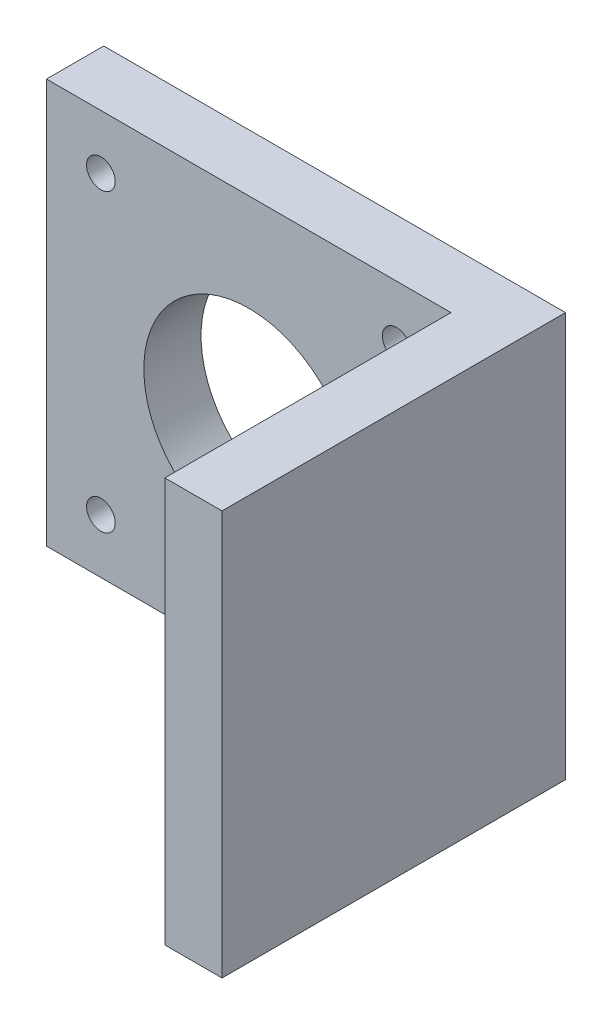
ISO-10303-21;
HEADER;
FILE_DESCRIPTION(('STEP AP214'),'2;1');
FILE_NAME('part.step','',(''),(''),'','','');
FILE_SCHEMA(('AUTOMOTIVE_DESIGN { 1 0 10303 214 1 1 1 1 }'));
ENDSEC;
DATA;
#1=APPLICATION_CONTEXT('core data for automotive mechanical design processes');
#2=APPLICATION_PROTOCOL_DEFINITION('international standard','automotive_design',2000,#1);
#3=PRODUCT_CONTEXT('',#1,'mechanical');
#4=PRODUCT('Part','Part','',(#3));
#5=PRODUCT_RELATED_PRODUCT_CATEGORY('part','',(#4));
#6=PRODUCT_DEFINITION_FORMATION('','',#4);
#7=PRODUCT_DEFINITION_CONTEXT('part definition',#1,'design');
#8=PRODUCT_DEFINITION('design','',#6,#7);
#9=PRODUCT_DEFINITION_SHAPE('','',#8);
#10=(LENGTH_UNIT() NAMED_UNIT(*) SI_UNIT(.MILLI.,.METRE.));
#11=(NAMED_UNIT(*) PLANE_ANGLE_UNIT() SI_UNIT($,.RADIAN.));
#12=(NAMED_UNIT(*) SI_UNIT($,.STERADIAN.) SOLID_ANGLE_UNIT());
#13=UNCERTAINTY_MEASURE_WITH_UNIT(LENGTH_MEASURE(1.E-05),#10,'distance_accuracy_value','');
#14=(GEOMETRIC_REPRESENTATION_CONTEXT(3) GLOBAL_UNCERTAINTY_ASSIGNED_CONTEXT((#13)) GLOBAL_UNIT_ASSIGNED_CONTEXT((#10,
#11,#12)) REPRESENTATION_CONTEXT('',''));
#15=CARTESIAN_POINT('',(0.,0.,0.));
#16=DIRECTION('',(0.,0.,1.));
#17=DIRECTION('',(1.,0.,0.));
#18=AXIS2_PLACEMENT_3D('',#15,#16,#17);
#19=CARTESIAN_POINT('',(-42.4,42.4,0.));
#20=DIRECTION('',(1.,0.,0.));
#21=DIRECTION('',(0.,0.,-1.));
#22=AXIS2_PLACEMENT_3D('',#19,#20,#21);
#23=PLANE('',#22);
#24=DIRECTION('',(0.,0.,1.));
#25=VECTOR('',#24,1.);
#26=CARTESIAN_POINT('',(-42.4,0.,0.));
#27=LINE('',#26,#25);
#28=CARTESIAN_POINT('',(-42.4,0.,-6.));
#29=VERTEX_POINT('',#28);
#30=CARTESIAN_POINT('',(-42.4,0.,0.));
#31=VERTEX_POINT('',#30);
#32=EDGE_CURVE('E121',#29,#31,#27,.T.);
#33=ORIENTED_EDGE('',*,*,#32,.T.);
#34=DIRECTION('',(0.,-1.,0.));
#35=VECTOR('',#34,1.);
#36=CARTESIAN_POINT('',(-42.4,42.4,0.));
#37=LINE('',#36,#35);
#38=CARTESIAN_POINT('',(-42.4,42.4,0.));
#39=VERTEX_POINT('',#38);
#40=EDGE_CURVE('E11',#39,#31,#37,.T.);
#41=ORIENTED_EDGE('',*,*,#40,.F.);
#42=DIRECTION('',(0.,0.,1.));
#43=VECTOR('',#42,1.);
#44=CARTESIAN_POINT('',(-42.4,42.4,0.));
#45=LINE('',#44,#43);
#46=CARTESIAN_POINT('',(-42.4,42.4,-6.));
#47=VERTEX_POINT('',#46);
#48=EDGE_CURVE('E132',#47,#39,#45,.T.);
#49=ORIENTED_EDGE('',*,*,#48,.F.);
#50=DIRECTION('',(0.,-1.,0.));
#51=VECTOR('',#50,1.);
#52=CARTESIAN_POINT('',(-42.4,42.4,-6.));
#53=LINE('',#52,#51);
#54=EDGE_CURVE('E117',#47,#29,#53,.T.);
#55=ORIENTED_EDGE('',*,*,#54,.T.);
#56=EDGE_LOOP('',(#33,#41,#49,#55));
#57=FACE_BOUND('',#56,.T.);
#58=ADVANCED_FACE('F37',(#57),#23,.F.);
#59=CARTESIAN_POINT('',(-42.4,42.4,0.));
#60=DIRECTION('',(0.,0.,-1.));
#61=DIRECTION('',(-1.,0.,0.));
#62=AXIS2_PLACEMENT_3D('',#59,#60,#61);
#63=PLANE('',#62);
#64=CARTESIAN_POINT('',(-36.7,5.7,0.));
#65=DIRECTION('',(0.,0.,1.));
#66=DIRECTION('',(1.,0.,0.));
#67=AXIS2_PLACEMENT_3D('',#64,#65,#66);
#68=CIRCLE('',#67,1.5);
#69=CARTESIAN_POINT('',(-35.2,5.7,0.));
#70=VERTEX_POINT('',#69);
#71=EDGE_CURVE('E261',#70,#70,#68,.T.);
#72=ORIENTED_EDGE('',*,*,#71,.F.);
#73=EDGE_LOOP('',(#72));
#74=FACE_BOUND('',#73,.T.);
#75=CARTESIAN_POINT('',(-5.70000000000001,5.7,0.));
#76=DIRECTION('',(0.,0.,1.));
#77=DIRECTION('',(1.,0.,0.));
#78=AXIS2_PLACEMENT_3D('',#75,#76,#77);
#79=CIRCLE('',#78,1.5);
#80=CARTESIAN_POINT('',(-4.20000000000001,5.7,0.));
#81=VERTEX_POINT('',#80);
#82=EDGE_CURVE('E263',#81,#81,#79,.T.);
#83=ORIENTED_EDGE('',*,*,#82,.F.);
#84=EDGE_LOOP('',(#83));
#85=FACE_BOUND('',#84,.T.);
#86=CARTESIAN_POINT('',(-5.70000000000001,36.7,0.));
#87=DIRECTION('',(0.,0.,1.));
#88=DIRECTION('',(1.,0.,0.));
#89=AXIS2_PLACEMENT_3D('',#86,#87,#88);
#90=CIRCLE('',#89,1.5);
#91=CARTESIAN_POINT('',(-4.20000000000001,36.7,0.));
#92=VERTEX_POINT('',#91);
#93=EDGE_CURVE('E287',#92,#92,#90,.T.);
#94=ORIENTED_EDGE('',*,*,#93,.F.);
#95=EDGE_LOOP('',(#94));
#96=FACE_BOUND('',#95,.T.);
#97=CARTESIAN_POINT('',(-36.7,36.7,0.));
#98=DIRECTION('',(0.,0.,1.));
#99=DIRECTION('',(1.,0.,0.));
#100=AXIS2_PLACEMENT_3D('',#97,#98,#99);
#101=CIRCLE('',#100,1.5);
#102=CARTESIAN_POINT('',(-35.2,36.7,0.));
#103=VERTEX_POINT('',#102);
#104=EDGE_CURVE('E277',#103,#103,#101,.T.);
#105=ORIENTED_EDGE('',*,*,#104,.F.);
#106=EDGE_LOOP('',(#105));
#107=FACE_BOUND('',#106,.T.);
#108=CARTESIAN_POINT('',(-21.2,21.2,0.));
#109=DIRECTION('',(0.,0.,1.));
#110=DIRECTION('',(1.,0.,0.));
#111=AXIS2_PLACEMENT_3D('',#108,#109,#110);
#112=CIRCLE('',#111,11.);
#113=CARTESIAN_POINT('',(-10.2,21.2,0.));
#114=VERTEX_POINT('',#113);
#115=EDGE_CURVE('E269',#114,#114,#112,.T.);
#116=ORIENTED_EDGE('',*,*,#115,.F.);
#117=EDGE_LOOP('',(#116));
#118=FACE_BOUND('',#117,.T.);
#119=DIRECTION('',(1.,0.,0.));
#120=VECTOR('',#119,1.);
#121=CARTESIAN_POINT('',(-42.4,0.,0.));
#122=LINE('',#121,#120);
#123=CARTESIAN_POINT('',(0.,0.,0.));
#124=VERTEX_POINT('',#123);
#125=EDGE_CURVE('E124',#31,#124,#122,.T.);
#126=ORIENTED_EDGE('',*,*,#125,.T.);
#127=DIRECTION('',(0.,-1.,0.));
#128=VECTOR('',#127,1.);
#129=CARTESIAN_POINT('',(0.,42.4,0.));
#130=LINE('',#129,#128);
#131=CARTESIAN_POINT('',(0.,42.4,0.));
#132=VERTEX_POINT('',#131);
#133=EDGE_CURVE('E45',#132,#124,#130,.T.);
#134=ORIENTED_EDGE('',*,*,#133,.F.);
#135=DIRECTION('',(1.,0.,0.));
#136=VECTOR('',#135,1.);
#137=CARTESIAN_POINT('',(-42.4,42.4,0.));
#138=LINE('',#137,#136);
#139=EDGE_CURVE('E90',#39,#132,#138,.T.);
#140=ORIENTED_EDGE('',*,*,#139,.F.);
#141=ORIENTED_EDGE('',*,*,#40,.T.);
#142=EDGE_LOOP('',(#126,#134,#140,#141));
#143=FACE_BOUND('',#142,.T.);
#144=ADVANCED_FACE('F159',(#74,#85,#96,#107,#118,#143),#63,.F.);
#145=CARTESIAN_POINT('',(0.,42.4,0.));
#146=DIRECTION('',(1.,0.,0.));
#147=DIRECTION('',(0.,0.,-1.));
#148=AXIS2_PLACEMENT_3D('',#145,#146,#147);
#149=PLANE('',#148);
#150=DIRECTION('',(0.,0.,1.));
#151=VECTOR('',#150,1.);
#152=CARTESIAN_POINT('',(0.,0.,0.));
#153=LINE('',#152,#151);
#154=CARTESIAN_POINT('',(0.,0.,30.));
#155=VERTEX_POINT('',#154);
#156=EDGE_CURVE('E127',#124,#155,#153,.T.);
#157=ORIENTED_EDGE('',*,*,#156,.T.);
#158=DIRECTION('',(0.,-1.,0.));
#159=VECTOR('',#158,1.);
#160=CARTESIAN_POINT('',(0.,42.4,30.));
#161=LINE('',#160,#159);
#162=CARTESIAN_POINT('',(0.,42.4,30.));
#163=VERTEX_POINT('',#162);
#164=EDGE_CURVE('E112',#163,#155,#161,.T.);
#165=ORIENTED_EDGE('',*,*,#164,.F.);
#166=DIRECTION('',(0.,0.,1.));
#167=VECTOR('',#166,1.);
#168=CARTESIAN_POINT('',(0.,42.4,0.));
#169=LINE('',#168,#167);
#170=EDGE_CURVE('E103',#132,#163,#169,.T.);
#171=ORIENTED_EDGE('',*,*,#170,.F.);
#172=ORIENTED_EDGE('',*,*,#133,.T.);
#173=EDGE_LOOP('',(#157,#165,#171,#172));
#174=FACE_BOUND('',#173,.T.);
#175=ADVANCED_FACE('F138',(#174),#149,.F.);
#176=CARTESIAN_POINT('',(6.,42.4,30.));
#177=DIRECTION('',(0.,0.,-1.));
#178=DIRECTION('',(-1.,0.,0.));
#179=AXIS2_PLACEMENT_3D('',#176,#177,#178);
#180=PLANE('',#179);
#181=DIRECTION('',(1.,0.,0.));
#182=VECTOR('',#181,1.);
#183=CARTESIAN_POINT('',(6.,0.,30.));
#184=LINE('',#183,#182);
#185=CARTESIAN_POINT('',(6.,0.,30.));
#186=VERTEX_POINT('',#185);
#187=EDGE_CURVE('E111',#155,#186,#184,.T.);
#188=ORIENTED_EDGE('',*,*,#187,.T.);
#189=DIRECTION('',(0.,-1.,0.));
#190=VECTOR('',#189,1.);
#191=CARTESIAN_POINT('',(6.,42.4,30.));
#192=LINE('',#191,#190);
#193=CARTESIAN_POINT('',(6.,42.4,30.));
#194=VERTEX_POINT('',#193);
#195=EDGE_CURVE('E108',#194,#186,#192,.T.);
#196=ORIENTED_EDGE('',*,*,#195,.F.);
#197=DIRECTION('',(1.,0.,0.));
#198=VECTOR('',#197,1.);
#199=CARTESIAN_POINT('',(6.,42.4,30.));
#200=LINE('',#199,#198);
#201=EDGE_CURVE('E97',#163,#194,#200,.T.);
#202=ORIENTED_EDGE('',*,*,#201,.F.);
#203=ORIENTED_EDGE('',*,*,#164,.T.);
#204=EDGE_LOOP('',(#188,#196,#202,#203));
#205=FACE_BOUND('',#204,.T.);
#206=ADVANCED_FACE('F109',(#205),#180,.F.);
#207=CARTESIAN_POINT('',(6.,42.4,-6.));
#208=DIRECTION('',(-1.,0.,0.));
#209=DIRECTION('',(0.,0.,1.));
#210=AXIS2_PLACEMENT_3D('',#207,#208,#209);
#211=PLANE('',#210);
#212=DIRECTION('',(0.,0.,-1.));
#213=VECTOR('',#212,1.);
#214=CARTESIAN_POINT('',(6.,0.,-6.));
#215=LINE('',#214,#213);
#216=CARTESIAN_POINT('',(6.,0.,-6.));
#217=VERTEX_POINT('',#216);
#218=EDGE_CURVE('E76',#186,#217,#215,.T.);
#219=ORIENTED_EDGE('',*,*,#218,.T.);
#220=DIRECTION('',(0.,-1.,0.));
#221=VECTOR('',#220,1.);
#222=CARTESIAN_POINT('',(6.,42.4,-6.));
#223=LINE('',#222,#221);
#224=CARTESIAN_POINT('',(6.,42.4,-6.));
#225=VERTEX_POINT('',#224);
#226=EDGE_CURVE('E113',#225,#217,#223,.T.);
#227=ORIENTED_EDGE('',*,*,#226,.F.);
#228=DIRECTION('',(0.,0.,-1.));
#229=VECTOR('',#228,1.);
#230=CARTESIAN_POINT('',(6.,42.4,-6.));
#231=LINE('',#230,#229);
#232=EDGE_CURVE('E101',#194,#225,#231,.T.);
#233=ORIENTED_EDGE('',*,*,#232,.F.);
#234=ORIENTED_EDGE('',*,*,#195,.T.);
#235=EDGE_LOOP('',(#219,#227,#233,#234));
#236=FACE_BOUND('',#235,.T.);
#237=ADVANCED_FACE('F115',(#236),#211,.F.);
#238=CARTESIAN_POINT('',(-42.4,42.4,-6.));
#239=DIRECTION('',(0.,0.,1.));
#240=DIRECTION('',(1.,0.,0.));
#241=AXIS2_PLACEMENT_3D('',#238,#239,#240);
#242=PLANE('',#241);
#243=CARTESIAN_POINT('',(-36.7,5.7,-6.));
#244=DIRECTION('',(0.,0.,1.));
#245=DIRECTION('',(1.,0.,0.));
#246=AXIS2_PLACEMENT_3D('',#243,#244,#245);
#247=CIRCLE('',#246,1.5);
#248=CARTESIAN_POINT('',(-35.2,5.7,-6.));
#249=VERTEX_POINT('',#248);
#250=EDGE_CURVE('E259',#249,#249,#247,.T.);
#251=ORIENTED_EDGE('',*,*,#250,.T.);
#252=EDGE_LOOP('',(#251));
#253=FACE_BOUND('',#252,.T.);
#254=CARTESIAN_POINT('',(-5.70000000000001,5.7,-6.));
#255=DIRECTION('',(0.,0.,1.));
#256=DIRECTION('',(1.,0.,0.));
#257=AXIS2_PLACEMENT_3D('',#254,#255,#256);
#258=CIRCLE('',#257,1.5);
#259=CARTESIAN_POINT('',(-4.20000000000001,5.7,-6.));
#260=VERTEX_POINT('',#259);
#261=EDGE_CURVE('E290',#260,#260,#258,.T.);
#262=ORIENTED_EDGE('',*,*,#261,.T.);
#263=EDGE_LOOP('',(#262));
#264=FACE_BOUND('',#263,.T.);
#265=CARTESIAN_POINT('',(-5.70000000000001,36.7,-6.));
#266=DIRECTION('',(0.,0.,1.));
#267=DIRECTION('',(1.,0.,0.));
#268=AXIS2_PLACEMENT_3D('',#265,#266,#267);
#269=CIRCLE('',#268,1.5);
#270=CARTESIAN_POINT('',(-4.20000000000001,36.7,-6.));
#271=VERTEX_POINT('',#270);
#272=EDGE_CURVE('E282',#271,#271,#269,.T.);
#273=ORIENTED_EDGE('',*,*,#272,.T.);
#274=EDGE_LOOP('',(#273));
#275=FACE_BOUND('',#274,.T.);
#276=CARTESIAN_POINT('',(-36.7,36.7,-6.));
#277=DIRECTION('',(0.,0.,1.));
#278=DIRECTION('',(1.,0.,0.));
#279=AXIS2_PLACEMENT_3D('',#276,#277,#278);
#280=CIRCLE('',#279,1.5);
#281=CARTESIAN_POINT('',(-35.2,36.7,-6.));
#282=VERTEX_POINT('',#281);
#283=EDGE_CURVE('E272',#282,#282,#280,.T.);
#284=ORIENTED_EDGE('',*,*,#283,.T.);
#285=EDGE_LOOP('',(#284));
#286=FACE_BOUND('',#285,.T.);
#287=CARTESIAN_POINT('',(-21.2,21.2,-6.));
#288=DIRECTION('',(0.,0.,1.));
#289=DIRECTION('',(1.,0.,0.));
#290=AXIS2_PLACEMENT_3D('',#287,#288,#289);
#291=CIRCLE('',#290,11.);
#292=CARTESIAN_POINT('',(-10.2,21.2,-6.));
#293=VERTEX_POINT('',#292);
#294=EDGE_CURVE('E125',#293,#293,#291,.T.);
#295=ORIENTED_EDGE('',*,*,#294,.T.);
#296=EDGE_LOOP('',(#295));
#297=FACE_BOUND('',#296,.T.);
#298=DIRECTION('',(-1.,0.,0.));
#299=VECTOR('',#298,1.);
#300=CARTESIAN_POINT('',(-42.4,0.,-6.));
#301=LINE('',#300,#299);
#302=EDGE_CURVE('E82',#217,#29,#301,.T.);
#303=ORIENTED_EDGE('',*,*,#302,.T.);
#304=ORIENTED_EDGE('',*,*,#54,.F.);
#305=DIRECTION('',(-1.,0.,0.));
#306=VECTOR('',#305,1.);
#307=CARTESIAN_POINT('',(-42.4,42.4,-6.));
#308=LINE('',#307,#306);
#309=EDGE_CURVE('E53',#225,#47,#308,.T.);
#310=ORIENTED_EDGE('',*,*,#309,.F.);
#311=ORIENTED_EDGE('',*,*,#226,.T.);
#312=EDGE_LOOP('',(#303,#304,#310,#311));
#313=FACE_BOUND('',#312,.T.);
#314=ADVANCED_FACE('F145',(#253,#264,#275,#286,#297,#313),#242,.F.);
#315=CARTESIAN_POINT('',(0.,42.4,0.));
#316=DIRECTION('',(0.,-1.,0.));
#317=DIRECTION('',(0.,0.,-1.));
#318=AXIS2_PLACEMENT_3D('',#315,#316,#317);
#319=PLANE('',#318);
#320=ORIENTED_EDGE('',*,*,#48,.T.);
#321=ORIENTED_EDGE('',*,*,#139,.T.);
#322=ORIENTED_EDGE('',*,*,#170,.T.);
#323=ORIENTED_EDGE('',*,*,#201,.T.);
#324=ORIENTED_EDGE('',*,*,#232,.T.);
#325=ORIENTED_EDGE('',*,*,#309,.T.);
#326=EDGE_LOOP('',(#320,#321,#322,#323,#324,#325));
#327=FACE_BOUND('',#326,.T.);
#328=ADVANCED_FACE('F99',(#327),#319,.F.);
#329=CARTESIAN_POINT('',(0.,0.,0.));
#330=DIRECTION('',(0.,-1.,0.));
#331=DIRECTION('',(0.,0.,-1.));
#332=AXIS2_PLACEMENT_3D('',#329,#330,#331);
#333=PLANE('',#332);
#334=ORIENTED_EDGE('',*,*,#32,.F.);
#335=ORIENTED_EDGE('',*,*,#302,.F.);
#336=ORIENTED_EDGE('',*,*,#218,.F.);
#337=ORIENTED_EDGE('',*,*,#187,.F.);
#338=ORIENTED_EDGE('',*,*,#156,.F.);
#339=ORIENTED_EDGE('',*,*,#125,.F.);
#340=EDGE_LOOP('',(#334,#335,#336,#337,#338,#339));
#341=FACE_BOUND('',#340,.T.);
#342=ADVANCED_FACE('F141',(#341),#333,.T.);
#343=CARTESIAN_POINT('',(-21.2,21.2,-6.));
#344=DIRECTION('',(0.,0.,1.));
#345=DIRECTION('',(1.,0.,0.));
#346=AXIS2_PLACEMENT_3D('',#343,#344,#345);
#347=CYLINDRICAL_SURFACE('',#346,11.);
#348=ORIENTED_EDGE('',*,*,#294,.F.);
#349=EDGE_LOOP('',(#348));
#350=FACE_BOUND('',#349,.T.);
#351=ORIENTED_EDGE('',*,*,#115,.T.);
#352=EDGE_LOOP('',(#351));
#353=FACE_BOUND('',#352,.T.);
#354=ADVANCED_FACE('F195',(#350,#353),#347,.F.);
#355=CARTESIAN_POINT('',(-36.7,36.7,-6.));
#356=DIRECTION('',(0.,0.,1.));
#357=DIRECTION('',(1.,0.,0.));
#358=AXIS2_PLACEMENT_3D('',#355,#356,#357);
#359=CYLINDRICAL_SURFACE('',#358,1.5);
#360=ORIENTED_EDGE('',*,*,#283,.F.);
#361=EDGE_LOOP('',(#360));
#362=FACE_BOUND('',#361,.T.);
#363=ORIENTED_EDGE('',*,*,#104,.T.);
#364=EDGE_LOOP('',(#363));
#365=FACE_BOUND('',#364,.T.);
#366=ADVANCED_FACE('F213',(#362,#365),#359,.F.);
#367=CARTESIAN_POINT('',(-5.70000000000001,36.7,-6.));
#368=DIRECTION('',(0.,0.,1.));
#369=DIRECTION('',(1.,0.,0.));
#370=AXIS2_PLACEMENT_3D('',#367,#368,#369);
#371=CYLINDRICAL_SURFACE('',#370,1.5);
#372=ORIENTED_EDGE('',*,*,#272,.F.);
#373=EDGE_LOOP('',(#372));
#374=FACE_BOUND('',#373,.T.);
#375=ORIENTED_EDGE('',*,*,#93,.T.);
#376=EDGE_LOOP('',(#375));
#377=FACE_BOUND('',#376,.T.);
#378=ADVANCED_FACE('F223',(#374,#377),#371,.F.);
#379=CARTESIAN_POINT('',(-5.70000000000001,5.7,-6.));
#380=DIRECTION('',(0.,0.,1.));
#381=DIRECTION('',(1.,0.,0.));
#382=AXIS2_PLACEMENT_3D('',#379,#380,#381);
#383=CYLINDRICAL_SURFACE('',#382,1.5);
#384=ORIENTED_EDGE('',*,*,#261,.F.);
#385=EDGE_LOOP('',(#384));
#386=FACE_BOUND('',#385,.T.);
#387=ORIENTED_EDGE('',*,*,#82,.T.);
#388=EDGE_LOOP('',(#387));
#389=FACE_BOUND('',#388,.T.);
#390=ADVANCED_FACE('F233',(#386,#389),#383,.F.);
#391=CARTESIAN_POINT('',(-36.7,5.7,-6.));
#392=DIRECTION('',(0.,0.,1.));
#393=DIRECTION('',(1.,0.,0.));
#394=AXIS2_PLACEMENT_3D('',#391,#392,#393);
#395=CYLINDRICAL_SURFACE('',#394,1.5);
#396=ORIENTED_EDGE('',*,*,#250,.F.);
#397=EDGE_LOOP('',(#396));
#398=FACE_BOUND('',#397,.T.);
#399=ORIENTED_EDGE('',*,*,#71,.T.);
#400=EDGE_LOOP('',(#399));
#401=FACE_BOUND('',#400,.T.);
#402=ADVANCED_FACE('F243',(#398,#401),#395,.F.);
#403=CLOSED_SHELL('',(#58,#144,#175,#206,#237,#314,#328,#342,#354,#366,#378,#390,#402));
#404=MANIFOLD_SOLID_BREP('B2',#403);
#405=ADVANCED_BREP_SHAPE_REPRESENTATION('',(#18,#404),#14);
#406=SHAPE_DEFINITION_REPRESENTATION(#9,#405);
ENDSEC;
END-ISO-10303-21;
